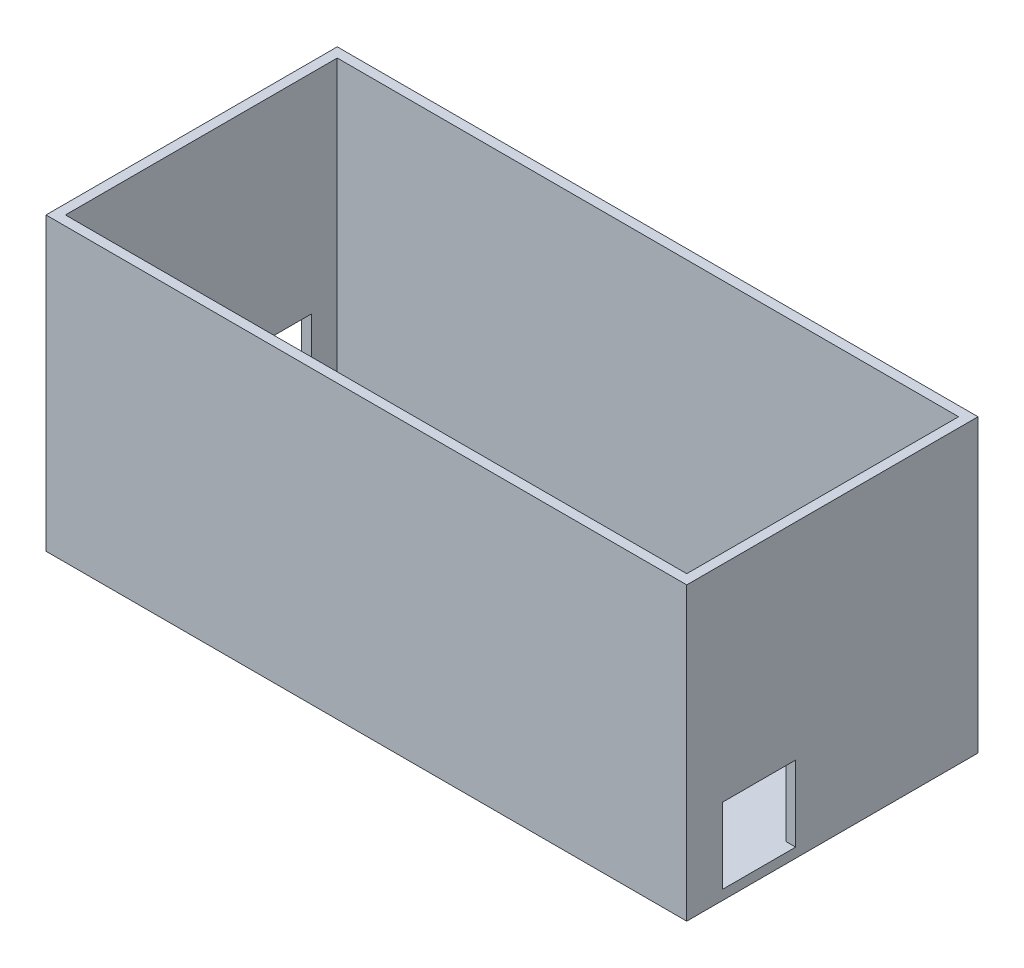
ISO-10303-21;
HEADER;
FILE_DESCRIPTION(('STEP AP214'),'2;1');
FILE_NAME('part.step','',(''),(''),'','','');
FILE_SCHEMA(('AUTOMOTIVE_DESIGN { 1 0 10303 214 1 1 1 1 }'));
ENDSEC;
DATA;
#1=APPLICATION_CONTEXT('core data for automotive mechanical design processes');
#2=APPLICATION_PROTOCOL_DEFINITION('international standard','automotive_design',2000,#1);
#3=PRODUCT_CONTEXT('',#1,'mechanical');
#4=PRODUCT('Part','Part','',(#3));
#5=PRODUCT_RELATED_PRODUCT_CATEGORY('part','',(#4));
#6=PRODUCT_DEFINITION_FORMATION('','',#4);
#7=PRODUCT_DEFINITION_CONTEXT('part definition',#1,'design');
#8=PRODUCT_DEFINITION('design','',#6,#7);
#9=PRODUCT_DEFINITION_SHAPE('','',#8);
#10=(LENGTH_UNIT() NAMED_UNIT(*) SI_UNIT(.MILLI.,.METRE.));
#11=(NAMED_UNIT(*) PLANE_ANGLE_UNIT() SI_UNIT($,.RADIAN.));
#12=(NAMED_UNIT(*) SI_UNIT($,.STERADIAN.) SOLID_ANGLE_UNIT());
#13=UNCERTAINTY_MEASURE_WITH_UNIT(LENGTH_MEASURE(1.E-05),#10,'distance_accuracy_value','');
#14=(GEOMETRIC_REPRESENTATION_CONTEXT(3) GLOBAL_UNCERTAINTY_ASSIGNED_CONTEXT((#13)) GLOBAL_UNIT_ASSIGNED_CONTEXT((#10,
#11,#12)) REPRESENTATION_CONTEXT('',''));
#15=CARTESIAN_POINT('',(0.,0.,0.));
#16=DIRECTION('',(0.,0.,1.));
#17=DIRECTION('',(1.,0.,0.));
#18=AXIS2_PLACEMENT_3D('',#15,#16,#17);
#19=CARTESIAN_POINT('',(0.,60.,0.));
#20=DIRECTION('',(0.,-1.,0.));
#21=DIRECTION('',(0.,0.,-1.));
#22=AXIS2_PLACEMENT_3D('',#19,#20,#21);
#23=PLANE('',#22);
#24=DIRECTION('',(0.,0.,1.));
#25=VECTOR('',#24,1.);
#26=CARTESIAN_POINT('',(0.,60.,0.));
#27=LINE('',#26,#25);
#28=CARTESIAN_POINT('',(0.,60.,-60.));
#29=VERTEX_POINT('',#28);
#30=CARTESIAN_POINT('',(0.,60.,0.));
#31=VERTEX_POINT('',#30);
#32=EDGE_CURVE('E250',#29,#31,#27,.T.);
#33=ORIENTED_EDGE('',*,*,#32,.T.);
#34=DIRECTION('',(1.,0.,0.));
#35=VECTOR('',#34,1.);
#36=CARTESIAN_POINT('',(0.,60.,0.));
#37=LINE('',#36,#35);
#38=CARTESIAN_POINT('',(132.,60.,0.));
#39=VERTEX_POINT('',#38);
#40=EDGE_CURVE('E253',#31,#39,#37,.T.);
#41=ORIENTED_EDGE('',*,*,#40,.T.);
#42=DIRECTION('',(0.,0.,-1.));
#43=VECTOR('',#42,1.);
#44=CARTESIAN_POINT('',(132.,60.,0.));
#45=LINE('',#44,#43);
#46=CARTESIAN_POINT('',(132.,60.,-60.));
#47=VERTEX_POINT('',#46);
#48=EDGE_CURVE('E256',#39,#47,#45,.T.);
#49=ORIENTED_EDGE('',*,*,#48,.T.);
#50=DIRECTION('',(-1.,0.,0.));
#51=VECTOR('',#50,1.);
#52=CARTESIAN_POINT('',(0.,60.,-60.));
#53=LINE('',#52,#51);
#54=EDGE_CURVE('E258',#47,#29,#53,.T.);
#55=ORIENTED_EDGE('',*,*,#54,.T.);
#56=EDGE_LOOP('',(#33,#41,#49,#55));
#57=FACE_BOUND('',#56,.T.);
#58=DIRECTION('',(0.,0.,1.));
#59=VECTOR('',#58,1.);
#60=CARTESIAN_POINT('',(2.,60.,0.));
#61=LINE('',#60,#59);
#62=CARTESIAN_POINT('',(1.99999999999997,60.,-58.));
#63=VERTEX_POINT('',#62);
#64=CARTESIAN_POINT('',(2.,60.,-2.));
#65=VERTEX_POINT('',#64);
#66=EDGE_CURVE('E242',#63,#65,#61,.T.);
#67=ORIENTED_EDGE('',*,*,#66,.F.);
#68=DIRECTION('',(-1.,0.,0.));
#69=VECTOR('',#68,1.);
#70=CARTESIAN_POINT('',(0.,60.,-58.));
#71=LINE('',#70,#69);
#72=CARTESIAN_POINT('',(130.,60.,-58.));
#73=VERTEX_POINT('',#72);
#74=EDGE_CURVE('E231',#73,#63,#71,.T.);
#75=ORIENTED_EDGE('',*,*,#74,.F.);
#76=DIRECTION('',(0.,0.,-1.));
#77=VECTOR('',#76,1.);
#78=CARTESIAN_POINT('',(130.,60.,0.));
#79=LINE('',#78,#77);
#80=CARTESIAN_POINT('',(130.,60.,-2.));
#81=VERTEX_POINT('',#80);
#82=EDGE_CURVE('E246',#81,#73,#79,.T.);
#83=ORIENTED_EDGE('',*,*,#82,.F.);
#84=DIRECTION('',(1.,0.,0.));
#85=VECTOR('',#84,1.);
#86=CARTESIAN_POINT('',(0.,60.,-2.));
#87=LINE('',#86,#85);
#88=EDGE_CURVE('E244',#65,#81,#87,.T.);
#89=ORIENTED_EDGE('',*,*,#88,.F.);
#90=EDGE_LOOP('',(#67,#75,#83,#89));
#91=FACE_BOUND('',#90,.T.);
#92=ADVANCED_FACE('F39',(#57,#91),#23,.F.);
#93=CARTESIAN_POINT('',(0.,60.,0.));
#94=DIRECTION('',(1.,0.,0.));
#95=DIRECTION('',(0.,0.,-1.));
#96=AXIS2_PLACEMENT_3D('',#93,#94,#95);
#97=PLANE('',#96);
#98=DIRECTION('',(0.,0.,-1.));
#99=VECTOR('',#98,1.);
#100=CARTESIAN_POINT('',(0.,2.,0.));
#101=LINE('',#100,#99);
#102=CARTESIAN_POINT('',(0.,2.,-37.3921861145021));
#103=VERTEX_POINT('',#102);
#104=CARTESIAN_POINT('',(0.,2.,-52.6623097205245));
#105=VERTEX_POINT('',#104);
#106=EDGE_CURVE('E211',#103,#105,#101,.T.);
#107=ORIENTED_EDGE('',*,*,#106,.T.);
#108=DIRECTION('',(0.,1.,0.));
#109=VECTOR('',#108,1.);
#110=CARTESIAN_POINT('',(0.,60.,-52.6623097205245));
#111=LINE('',#110,#109);
#112=CARTESIAN_POINT('',(0.,17.0061977583487,-52.6623097205245));
#113=VERTEX_POINT('',#112);
#114=EDGE_CURVE('E214',#105,#113,#111,.T.);
#115=ORIENTED_EDGE('',*,*,#114,.T.);
#116=DIRECTION('',(0.,0.,1.));
#117=VECTOR('',#116,1.);
#118=CARTESIAN_POINT('',(0.,17.0061977583487,0.));
#119=LINE('',#118,#117);
#120=CARTESIAN_POINT('',(0.,17.0061977583487,-37.3921861145021));
#121=VERTEX_POINT('',#120);
#122=EDGE_CURVE('E199',#113,#121,#119,.T.);
#123=ORIENTED_EDGE('',*,*,#122,.T.);
#124=DIRECTION('',(0.,-1.,0.));
#125=VECTOR('',#124,1.);
#126=CARTESIAN_POINT('',(0.,60.,-37.3921861145021));
#127=LINE('',#126,#125);
#128=EDGE_CURVE('E208',#121,#103,#127,.T.);
#129=ORIENTED_EDGE('',*,*,#128,.T.);
#130=EDGE_LOOP('',(#107,#115,#123,#129));
#131=FACE_BOUND('',#130,.T.);
#132=DIRECTION('',(0.,0.,1.));
#133=VECTOR('',#132,1.);
#134=CARTESIAN_POINT('',(0.,0.,0.));
#135=LINE('',#134,#133);
#136=CARTESIAN_POINT('',(0.,0.,-60.));
#137=VERTEX_POINT('',#136);
#138=CARTESIAN_POINT('',(0.,0.,0.));
#139=VERTEX_POINT('',#138);
#140=EDGE_CURVE('E225',#137,#139,#135,.T.);
#141=ORIENTED_EDGE('',*,*,#140,.T.);
#142=DIRECTION('',(0.,-1.,0.));
#143=VECTOR('',#142,1.);
#144=CARTESIAN_POINT('',(0.,60.,0.));
#145=LINE('',#144,#143);
#146=EDGE_CURVE('E11',#31,#139,#145,.T.);
#147=ORIENTED_EDGE('',*,*,#146,.F.);
#148=ORIENTED_EDGE('',*,*,#32,.F.);
#149=DIRECTION('',(0.,-1.,0.));
#150=VECTOR('',#149,1.);
#151=CARTESIAN_POINT('',(0.,60.,-60.));
#152=LINE('',#151,#150);
#153=EDGE_CURVE('E260',#29,#137,#152,.T.);
#154=ORIENTED_EDGE('',*,*,#153,.T.);
#155=EDGE_LOOP('',(#141,#147,#148,#154));
#156=FACE_BOUND('',#155,.T.);
#157=ADVANCED_FACE('F41',(#131,#156),#97,.F.);
#158=CARTESIAN_POINT('',(0.,60.,0.));
#159=DIRECTION('',(0.,0.,-1.));
#160=DIRECTION('',(-1.,0.,0.));
#161=AXIS2_PLACEMENT_3D('',#158,#159,#160);
#162=PLANE('',#161);
#163=DIRECTION('',(1.,0.,0.));
#164=VECTOR('',#163,1.);
#165=CARTESIAN_POINT('',(0.,0.,0.));
#166=LINE('',#165,#164);
#167=CARTESIAN_POINT('',(132.,0.,0.));
#168=VERTEX_POINT('',#167);
#169=EDGE_CURVE('E263',#139,#168,#166,.T.);
#170=ORIENTED_EDGE('',*,*,#169,.T.);
#171=DIRECTION('',(0.,-1.,0.));
#172=VECTOR('',#171,1.);
#173=CARTESIAN_POINT('',(132.,60.,0.));
#174=LINE('',#173,#172);
#175=EDGE_CURVE('E47',#39,#168,#174,.T.);
#176=ORIENTED_EDGE('',*,*,#175,.F.);
#177=ORIENTED_EDGE('',*,*,#40,.F.);
#178=ORIENTED_EDGE('',*,*,#146,.T.);
#179=EDGE_LOOP('',(#170,#176,#177,#178));
#180=FACE_BOUND('',#179,.T.);
#181=ADVANCED_FACE('F293',(#180),#162,.F.);
#182=CARTESIAN_POINT('',(132.,60.,0.));
#183=DIRECTION('',(-1.,0.,0.));
#184=DIRECTION('',(0.,0.,1.));
#185=AXIS2_PLACEMENT_3D('',#182,#183,#184);
#186=PLANE('',#185);
#187=DIRECTION('',(0.,0.,1.));
#188=VECTOR('',#187,1.);
#189=CARTESIAN_POINT('',(132.,2.,0.));
#190=LINE('',#189,#188);
#191=CARTESIAN_POINT('',(132.,2.,-22.4317786421012));
#192=VERTEX_POINT('',#191);
#193=CARTESIAN_POINT('',(132.,2.,-7.31762084234339));
#194=VERTEX_POINT('',#193);
#195=EDGE_CURVE('E183',#192,#194,#190,.T.);
#196=ORIENTED_EDGE('',*,*,#195,.T.);
#197=DIRECTION('',(0.,1.,0.));
#198=VECTOR('',#197,1.);
#199=CARTESIAN_POINT('',(132.,60.,-7.31762084234339));
#200=LINE('',#199,#198);
#201=CARTESIAN_POINT('',(132.,17.5421414717221,-7.31762084234339));
#202=VERTEX_POINT('',#201);
#203=EDGE_CURVE('E186',#194,#202,#200,.T.);
#204=ORIENTED_EDGE('',*,*,#203,.T.);
#205=DIRECTION('',(0.,0.,-1.));
#206=VECTOR('',#205,1.);
#207=CARTESIAN_POINT('',(132.,17.5421414717221,0.));
#208=LINE('',#207,#206);
#209=CARTESIAN_POINT('',(132.,17.5421414717221,-22.4317786421012));
#210=VERTEX_POINT('',#209);
#211=EDGE_CURVE('E157',#202,#210,#208,.T.);
#212=ORIENTED_EDGE('',*,*,#211,.T.);
#213=DIRECTION('',(0.,-1.,0.));
#214=VECTOR('',#213,1.);
#215=CARTESIAN_POINT('',(132.,60.,-22.4317786421012));
#216=LINE('',#215,#214);
#217=EDGE_CURVE('E180',#210,#192,#216,.T.);
#218=ORIENTED_EDGE('',*,*,#217,.T.);
#219=EDGE_LOOP('',(#196,#204,#212,#218));
#220=FACE_BOUND('',#219,.T.);
#221=DIRECTION('',(0.,0.,-1.));
#222=VECTOR('',#221,1.);
#223=CARTESIAN_POINT('',(132.,0.,0.));
#224=LINE('',#223,#222);
#225=CARTESIAN_POINT('',(132.,0.,-60.));
#226=VERTEX_POINT('',#225);
#227=EDGE_CURVE('E265',#168,#226,#224,.T.);
#228=ORIENTED_EDGE('',*,*,#227,.T.);
#229=DIRECTION('',(0.,-1.,0.));
#230=VECTOR('',#229,1.);
#231=CARTESIAN_POINT('',(132.,60.,-60.));
#232=LINE('',#231,#230);
#233=EDGE_CURVE('E270',#47,#226,#232,.T.);
#234=ORIENTED_EDGE('',*,*,#233,.F.);
#235=ORIENTED_EDGE('',*,*,#48,.F.);
#236=ORIENTED_EDGE('',*,*,#175,.T.);
#237=EDGE_LOOP('',(#228,#234,#235,#236));
#238=FACE_BOUND('',#237,.T.);
#239=ADVANCED_FACE('F277',(#220,#238),#186,.F.);
#240=CARTESIAN_POINT('',(0.,60.,-60.));
#241=DIRECTION('',(0.,0.,1.));
#242=DIRECTION('',(1.,0.,0.));
#243=AXIS2_PLACEMENT_3D('',#240,#241,#242);
#244=PLANE('',#243);
#245=DIRECTION('',(-1.,0.,0.));
#246=VECTOR('',#245,1.);
#247=CARTESIAN_POINT('',(0.,0.,-60.));
#248=LINE('',#247,#246);
#249=EDGE_CURVE('E254',#226,#137,#248,.T.);
#250=ORIENTED_EDGE('',*,*,#249,.T.);
#251=ORIENTED_EDGE('',*,*,#153,.F.);
#252=ORIENTED_EDGE('',*,*,#54,.F.);
#253=ORIENTED_EDGE('',*,*,#233,.T.);
#254=EDGE_LOOP('',(#250,#251,#252,#253));
#255=FACE_BOUND('',#254,.T.);
#256=ADVANCED_FACE('F286',(#255),#244,.F.);
#257=CARTESIAN_POINT('',(0.,0.,0.));
#258=DIRECTION('',(0.,-1.,0.));
#259=DIRECTION('',(0.,0.,-1.));
#260=AXIS2_PLACEMENT_3D('',#257,#258,#259);
#261=PLANE('',#260);
#262=ORIENTED_EDGE('',*,*,#140,.F.);
#263=ORIENTED_EDGE('',*,*,#249,.F.);
#264=ORIENTED_EDGE('',*,*,#227,.F.);
#265=ORIENTED_EDGE('',*,*,#169,.F.);
#266=EDGE_LOOP('',(#262,#263,#264,#265));
#267=FACE_BOUND('',#266,.T.);
#268=ADVANCED_FACE('F283',(#267),#261,.T.);
#269=CARTESIAN_POINT('',(2.,60.,0.));
#270=DIRECTION('',(1.,0.,0.));
#271=DIRECTION('',(0.,0.,-1.));
#272=AXIS2_PLACEMENT_3D('',#269,#270,#271);
#273=PLANE('',#272);
#274=DIRECTION('',(0.,1.,0.));
#275=VECTOR('',#274,1.);
#276=CARTESIAN_POINT('',(1.99999999999998,2.,-52.6623097205245));
#277=LINE('',#276,#275);
#278=CARTESIAN_POINT('',(1.99999999999998,2.,-52.6623097205245));
#279=VERTEX_POINT('',#278);
#280=CARTESIAN_POINT('',(1.99999999999998,17.0061977583487,-52.6623097205245));
#281=VERTEX_POINT('',#280);
#282=EDGE_CURVE('E188',#279,#281,#277,.T.);
#283=ORIENTED_EDGE('',*,*,#282,.F.);
#284=DIRECTION('',(0.,0.,1.));
#285=VECTOR('',#284,1.);
#286=CARTESIAN_POINT('',(2.,2.,0.));
#287=LINE('',#286,#285);
#288=CARTESIAN_POINT('',(1.99999999999997,2.,-58.));
#289=VERTEX_POINT('',#288);
#290=EDGE_CURVE('E218',#289,#279,#287,.T.);
#291=ORIENTED_EDGE('',*,*,#290,.F.);
#292=DIRECTION('',(0.,-1.,0.));
#293=VECTOR('',#292,1.);
#294=CARTESIAN_POINT('',(1.99999999999997,60.,-58.));
#295=LINE('',#294,#293);
#296=EDGE_CURVE('E227',#63,#289,#295,.T.);
#297=ORIENTED_EDGE('',*,*,#296,.F.);
#298=ORIENTED_EDGE('',*,*,#66,.T.);
#299=DIRECTION('',(0.,-1.,0.));
#300=VECTOR('',#299,1.);
#301=CARTESIAN_POINT('',(2.,60.,-2.));
#302=LINE('',#301,#300);
#303=CARTESIAN_POINT('',(2.,2.,-2.));
#304=VERTEX_POINT('',#303);
#305=EDGE_CURVE('E222',#65,#304,#302,.T.);
#306=ORIENTED_EDGE('',*,*,#305,.T.);
#307=CARTESIAN_POINT('',(1.99999999999998,2.,-37.3921861145021));
#308=VERTEX_POINT('',#307);
#309=EDGE_CURVE('E217',#308,#304,#287,.T.);
#310=ORIENTED_EDGE('',*,*,#309,.F.);
#311=DIRECTION('',(0.,-1.,0.));
#312=VECTOR('',#311,1.);
#313=CARTESIAN_POINT('',(1.99999999999998,2.,-37.3921861145021));
#314=LINE('',#313,#312);
#315=CARTESIAN_POINT('',(1.99999999999998,17.0061977583487,-37.3921861145021));
#316=VERTEX_POINT('',#315);
#317=EDGE_CURVE('E194',#316,#308,#314,.T.);
#318=ORIENTED_EDGE('',*,*,#317,.F.);
#319=DIRECTION('',(0.,0.,1.));
#320=VECTOR('',#319,1.);
#321=CARTESIAN_POINT('',(1.99999999999998,17.0061977583487,-52.6623097205245));
#322=LINE('',#321,#320);
#323=EDGE_CURVE('E191',#281,#316,#322,.T.);
#324=ORIENTED_EDGE('',*,*,#323,.F.);
#325=EDGE_LOOP('',(#283,#291,#297,#298,#306,#310,#318,#324));
#326=FACE_BOUND('',#325,.T.);
#327=ADVANCED_FACE('F312',(#326),#273,.T.);
#328=CARTESIAN_POINT('',(0.,60.,-2.));
#329=DIRECTION('',(0.,0.,-1.));
#330=DIRECTION('',(-1.,0.,0.));
#331=AXIS2_PLACEMENT_3D('',#328,#329,#330);
#332=PLANE('',#331);
#333=DIRECTION('',(1.,0.,0.));
#334=VECTOR('',#333,1.);
#335=CARTESIAN_POINT('',(0.,2.,-2.));
#336=LINE('',#335,#334);
#337=CARTESIAN_POINT('',(130.,2.,-2.));
#338=VERTEX_POINT('',#337);
#339=EDGE_CURVE('E221',#304,#338,#336,.T.);
#340=ORIENTED_EDGE('',*,*,#339,.F.);
#341=ORIENTED_EDGE('',*,*,#305,.F.);
#342=ORIENTED_EDGE('',*,*,#88,.T.);
#343=DIRECTION('',(0.,-1.,0.));
#344=VECTOR('',#343,1.);
#345=CARTESIAN_POINT('',(130.,60.,-2.));
#346=LINE('',#345,#344);
#347=EDGE_CURVE('E226',#81,#338,#346,.T.);
#348=ORIENTED_EDGE('',*,*,#347,.T.);
#349=EDGE_LOOP('',(#340,#341,#342,#348));
#350=FACE_BOUND('',#349,.T.);
#351=ADVANCED_FACE('F328',(#350),#332,.T.);
#352=CARTESIAN_POINT('',(130.,60.,0.));
#353=DIRECTION('',(-1.,0.,0.));
#354=DIRECTION('',(0.,0.,1.));
#355=AXIS2_PLACEMENT_3D('',#352,#353,#354);
#356=PLANE('',#355);
#357=DIRECTION('',(0.,1.,0.));
#358=VECTOR('',#357,1.);
#359=CARTESIAN_POINT('',(130.,2.,-7.31762084234339));
#360=LINE('',#359,#358);
#361=CARTESIAN_POINT('',(130.,2.,-7.31762084234339));
#362=VERTEX_POINT('',#361);
#363=CARTESIAN_POINT('',(130.,17.5421414717221,-7.31762084234339));
#364=VERTEX_POINT('',#363);
#365=EDGE_CURVE('E162',#362,#364,#360,.T.);
#366=ORIENTED_EDGE('',*,*,#365,.F.);
#367=DIRECTION('',(0.,0.,-1.));
#368=VECTOR('',#367,1.);
#369=CARTESIAN_POINT('',(130.,2.,0.));
#370=LINE('',#369,#368);
#371=EDGE_CURVE('E236',#338,#362,#370,.T.);
#372=ORIENTED_EDGE('',*,*,#371,.F.);
#373=ORIENTED_EDGE('',*,*,#347,.F.);
#374=ORIENTED_EDGE('',*,*,#82,.T.);
#375=DIRECTION('',(0.,-1.,0.));
#376=VECTOR('',#375,1.);
#377=CARTESIAN_POINT('',(130.,60.,-58.));
#378=LINE('',#377,#376);
#379=CARTESIAN_POINT('',(130.,2.,-58.));
#380=VERTEX_POINT('',#379);
#381=EDGE_CURVE('E230',#73,#380,#378,.T.);
#382=ORIENTED_EDGE('',*,*,#381,.T.);
#383=CARTESIAN_POINT('',(130.,2.,-22.4317786421012));
#384=VERTEX_POINT('',#383);
#385=EDGE_CURVE('E233',#384,#380,#370,.T.);
#386=ORIENTED_EDGE('',*,*,#385,.F.);
#387=DIRECTION('',(0.,-1.,0.));
#388=VECTOR('',#387,1.);
#389=CARTESIAN_POINT('',(130.,2.,-22.4317786421012));
#390=LINE('',#389,#388);
#391=CARTESIAN_POINT('',(130.,17.5421414717221,-22.4317786421012));
#392=VERTEX_POINT('',#391);
#393=EDGE_CURVE('E61',#392,#384,#390,.T.);
#394=ORIENTED_EDGE('',*,*,#393,.F.);
#395=DIRECTION('',(0.,0.,-1.));
#396=VECTOR('',#395,1.);
#397=CARTESIAN_POINT('',(130.,17.5421414717221,-7.31762084234339));
#398=LINE('',#397,#396);
#399=EDGE_CURVE('E155',#364,#392,#398,.T.);
#400=ORIENTED_EDGE('',*,*,#399,.F.);
#401=EDGE_LOOP('',(#366,#372,#373,#374,#382,#386,#394,#400));
#402=FACE_BOUND('',#401,.T.);
#403=ADVANCED_FACE('F170',(#402),#356,.T.);
#404=CARTESIAN_POINT('',(0.,60.,-58.));
#405=DIRECTION('',(0.,0.,1.));
#406=DIRECTION('',(1.,0.,0.));
#407=AXIS2_PLACEMENT_3D('',#404,#405,#406);
#408=PLANE('',#407);
#409=DIRECTION('',(-1.,0.,0.));
#410=VECTOR('',#409,1.);
#411=CARTESIAN_POINT('',(0.,2.,-58.));
#412=LINE('',#411,#410);
#413=EDGE_CURVE('E238',#380,#289,#412,.T.);
#414=ORIENTED_EDGE('',*,*,#413,.F.);
#415=ORIENTED_EDGE('',*,*,#381,.F.);
#416=ORIENTED_EDGE('',*,*,#74,.T.);
#417=ORIENTED_EDGE('',*,*,#296,.T.);
#418=EDGE_LOOP('',(#414,#415,#416,#417));
#419=FACE_BOUND('',#418,.T.);
#420=ADVANCED_FACE('F343',(#419),#408,.T.);
#421=CARTESIAN_POINT('',(0.,2.,0.));
#422=DIRECTION('',(0.,-1.,0.));
#423=DIRECTION('',(0.,0.,-1.));
#424=AXIS2_PLACEMENT_3D('',#421,#422,#423);
#425=PLANE('',#424);
#426=ORIENTED_EDGE('',*,*,#290,.T.);
#427=DIRECTION('',(1.,0.,0.));
#428=VECTOR('',#427,1.);
#429=CARTESIAN_POINT('',(-148.,2.,-52.6623097205245));
#430=LINE('',#429,#428);
#431=EDGE_CURVE('E197',#105,#279,#430,.T.);
#432=ORIENTED_EDGE('',*,*,#431,.F.);
#433=ORIENTED_EDGE('',*,*,#106,.F.);
#434=DIRECTION('',(1.,0.,0.));
#435=VECTOR('',#434,1.);
#436=CARTESIAN_POINT('',(-148.,2.,-37.3921861145021));
#437=LINE('',#436,#435);
#438=EDGE_CURVE('E200',#103,#308,#437,.T.);
#439=ORIENTED_EDGE('',*,*,#438,.T.);
#440=ORIENTED_EDGE('',*,*,#309,.T.);
#441=ORIENTED_EDGE('',*,*,#339,.T.);
#442=ORIENTED_EDGE('',*,*,#371,.T.);
#443=DIRECTION('',(-1.,0.,0.));
#444=VECTOR('',#443,1.);
#445=CARTESIAN_POINT('',(280.,2.,-7.31762084234346));
#446=LINE('',#445,#444);
#447=EDGE_CURVE('E165',#194,#362,#446,.T.);
#448=ORIENTED_EDGE('',*,*,#447,.F.);
#449=ORIENTED_EDGE('',*,*,#195,.F.);
#450=DIRECTION('',(-1.,0.,0.));
#451=VECTOR('',#450,1.);
#452=CARTESIAN_POINT('',(280.,2.,-22.4317786421012));
#453=LINE('',#452,#451);
#454=EDGE_CURVE('E176',#192,#384,#453,.T.);
#455=ORIENTED_EDGE('',*,*,#454,.T.);
#456=ORIENTED_EDGE('',*,*,#385,.T.);
#457=ORIENTED_EDGE('',*,*,#413,.T.);
#458=EDGE_LOOP('',(#426,#432,#433,#439,#440,#441,#442,#448,#449,#455,#456,#457));
#459=FACE_BOUND('',#458,.T.);
#460=ADVANCED_FACE('F308',(#459),#425,.F.);
#461=CARTESIAN_POINT('',(-148.,2.,-52.6623097205245));
#462=DIRECTION('',(0.,0.,-1.));
#463=DIRECTION('',(-1.,0.,0.));
#464=AXIS2_PLACEMENT_3D('',#461,#462,#463);
#465=PLANE('',#464);
#466=ORIENTED_EDGE('',*,*,#431,.T.);
#467=ORIENTED_EDGE('',*,*,#282,.T.);
#468=DIRECTION('',(1.,0.,0.));
#469=VECTOR('',#468,1.);
#470=CARTESIAN_POINT('',(-148.,17.0061977583487,-52.6623097205245));
#471=LINE('',#470,#469);
#472=EDGE_CURVE('E196',#113,#281,#471,.T.);
#473=ORIENTED_EDGE('',*,*,#472,.F.);
#474=ORIENTED_EDGE('',*,*,#114,.F.);
#475=EDGE_LOOP('',(#466,#467,#473,#474));
#476=FACE_BOUND('',#475,.T.);
#477=ADVANCED_FACE('F356',(#476),#465,.F.);
#478=CARTESIAN_POINT('',(-148.,2.,-37.3921861145021));
#479=DIRECTION('',(0.,0.,1.));
#480=DIRECTION('',(1.,0.,0.));
#481=AXIS2_PLACEMENT_3D('',#478,#479,#480);
#482=PLANE('',#481);
#483=DIRECTION('',(1.,0.,0.));
#484=VECTOR('',#483,1.);
#485=CARTESIAN_POINT('',(-148.,17.0061977583487,-37.3921861145021));
#486=LINE('',#485,#484);
#487=EDGE_CURVE('E203',#121,#316,#486,.T.);
#488=ORIENTED_EDGE('',*,*,#487,.T.);
#489=ORIENTED_EDGE('',*,*,#317,.T.);
#490=ORIENTED_EDGE('',*,*,#438,.F.);
#491=ORIENTED_EDGE('',*,*,#128,.F.);
#492=EDGE_LOOP('',(#488,#489,#490,#491));
#493=FACE_BOUND('',#492,.T.);
#494=ADVANCED_FACE('F363',(#493),#482,.F.);
#495=CARTESIAN_POINT('',(-148.,17.0061977583487,-52.6623097205245));
#496=DIRECTION('',(0.,1.,0.));
#497=DIRECTION('',(0.,0.,1.));
#498=AXIS2_PLACEMENT_3D('',#495,#496,#497);
#499=PLANE('',#498);
#500=ORIENTED_EDGE('',*,*,#472,.T.);
#501=ORIENTED_EDGE('',*,*,#323,.T.);
#502=ORIENTED_EDGE('',*,*,#487,.F.);
#503=ORIENTED_EDGE('',*,*,#122,.F.);
#504=EDGE_LOOP('',(#500,#501,#502,#503));
#505=FACE_BOUND('',#504,.T.);
#506=ADVANCED_FACE('F371',(#505),#499,.F.);
#507=CARTESIAN_POINT('',(280.,2.,-7.31762084234346));
#508=DIRECTION('',(0.,0.,1.));
#509=DIRECTION('',(1.,0.,0.));
#510=AXIS2_PLACEMENT_3D('',#507,#508,#509);
#511=PLANE('',#510);
#512=ORIENTED_EDGE('',*,*,#447,.T.);
#513=ORIENTED_EDGE('',*,*,#365,.T.);
#514=DIRECTION('',(-1.,0.,0.));
#515=VECTOR('',#514,1.);
#516=CARTESIAN_POINT('',(280.,17.5421414717221,-7.31762084234346));
#517=LINE('',#516,#515);
#518=EDGE_CURVE('E151',#202,#364,#517,.T.);
#519=ORIENTED_EDGE('',*,*,#518,.F.);
#520=ORIENTED_EDGE('',*,*,#203,.F.);
#521=EDGE_LOOP('',(#512,#513,#519,#520));
#522=FACE_BOUND('',#521,.T.);
#523=ADVANCED_FACE('F163',(#522),#511,.F.);
#524=CARTESIAN_POINT('',(280.,2.,-22.4317786421012));
#525=DIRECTION('',(0.,0.,-1.));
#526=DIRECTION('',(-1.,0.,0.));
#527=AXIS2_PLACEMENT_3D('',#524,#525,#526);
#528=PLANE('',#527);
#529=DIRECTION('',(-1.,0.,0.));
#530=VECTOR('',#529,1.);
#531=CARTESIAN_POINT('',(280.,17.5421414717221,-22.4317786421012));
#532=LINE('',#531,#530);
#533=EDGE_CURVE('E54',#210,#392,#532,.T.);
#534=ORIENTED_EDGE('',*,*,#533,.T.);
#535=ORIENTED_EDGE('',*,*,#393,.T.);
#536=ORIENTED_EDGE('',*,*,#454,.F.);
#537=ORIENTED_EDGE('',*,*,#217,.F.);
#538=EDGE_LOOP('',(#534,#535,#536,#537));
#539=FACE_BOUND('',#538,.T.);
#540=ADVANCED_FACE('F386',(#539),#528,.F.);
#541=CARTESIAN_POINT('',(280.,17.5421414717221,-7.31762084234346));
#542=DIRECTION('',(0.,1.,0.));
#543=DIRECTION('',(0.,0.,1.));
#544=AXIS2_PLACEMENT_3D('',#541,#542,#543);
#545=PLANE('',#544);
#546=ORIENTED_EDGE('',*,*,#518,.T.);
#547=ORIENTED_EDGE('',*,*,#399,.T.);
#548=ORIENTED_EDGE('',*,*,#533,.F.);
#549=ORIENTED_EDGE('',*,*,#211,.F.);
#550=EDGE_LOOP('',(#546,#547,#548,#549));
#551=FACE_BOUND('',#550,.T.);
#552=ADVANCED_FACE('F153',(#551),#545,.F.);
#553=CLOSED_SHELL('',(#92,#157,#181,#239,#256,#268,#327,#351,#403,#420,#460,#477,#494,#506,#523,
#540,#552));
#554=MANIFOLD_SOLID_BREP('B2',#553);
#555=ADVANCED_BREP_SHAPE_REPRESENTATION('',(#18,#554),#14);
#556=SHAPE_DEFINITION_REPRESENTATION(#9,#555);
ENDSEC;
END-ISO-10303-21;
